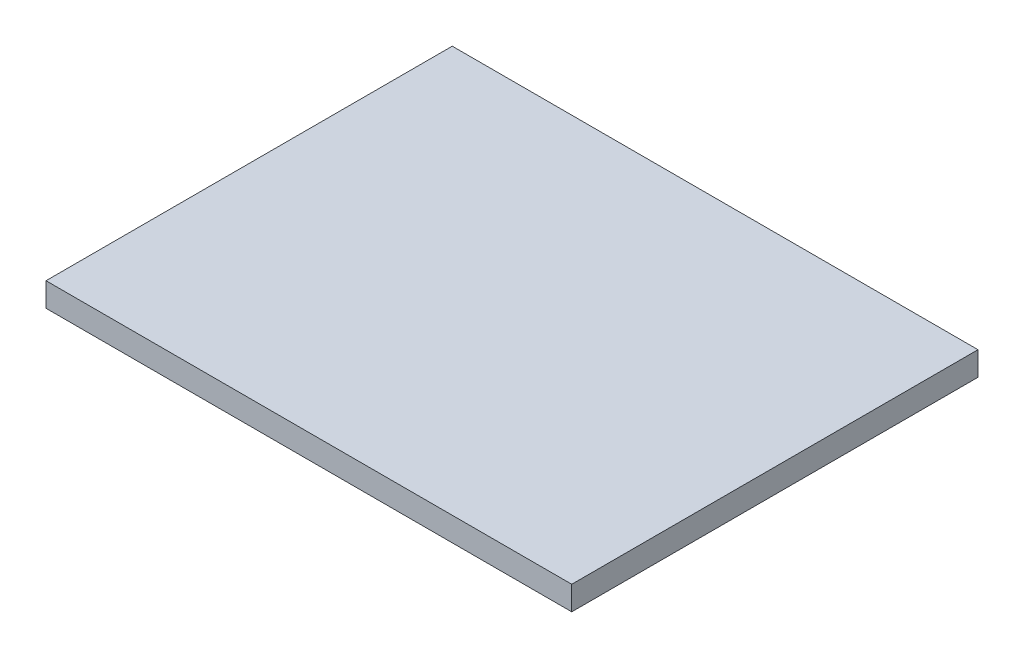
ISO-10303-21;
HEADER;
FILE_DESCRIPTION(('STEP AP214'),'2;1');
FILE_NAME('part.step','',(''),(''),'','','');
FILE_SCHEMA(('AUTOMOTIVE_DESIGN { 1 0 10303 214 1 1 1 1 }'));
ENDSEC;
DATA;
#1=APPLICATION_CONTEXT('core data for automotive mechanical design processes');
#2=APPLICATION_PROTOCOL_DEFINITION('international standard','automotive_design',2000,#1);
#3=PRODUCT_CONTEXT('',#1,'mechanical');
#4=PRODUCT('Part','Part','',(#3));
#5=PRODUCT_RELATED_PRODUCT_CATEGORY('part','',(#4));
#6=PRODUCT_DEFINITION_FORMATION('','',#4);
#7=PRODUCT_DEFINITION_CONTEXT('part definition',#1,'design');
#8=PRODUCT_DEFINITION('design','',#6,#7);
#9=PRODUCT_DEFINITION_SHAPE('','',#8);
#10=(LENGTH_UNIT() NAMED_UNIT(*) SI_UNIT(.MILLI.,.METRE.));
#11=(NAMED_UNIT(*) PLANE_ANGLE_UNIT() SI_UNIT($,.RADIAN.));
#12=(NAMED_UNIT(*) SI_UNIT($,.STERADIAN.) SOLID_ANGLE_UNIT());
#13=UNCERTAINTY_MEASURE_WITH_UNIT(LENGTH_MEASURE(1.E-05),#10,'distance_accuracy_value','');
#14=(GEOMETRIC_REPRESENTATION_CONTEXT(3) GLOBAL_UNCERTAINTY_ASSIGNED_CONTEXT((#13)) GLOBAL_UNIT_ASSIGNED_CONTEXT((#10,
#11,#12)) REPRESENTATION_CONTEXT('',''));
#15=CARTESIAN_POINT('',(0.,0.,0.));
#16=DIRECTION('',(0.,0.,1.));
#17=DIRECTION('',(1.,0.,0.));
#18=AXIS2_PLACEMENT_3D('',#15,#16,#17);
#19=CARTESIAN_POINT('',(22.,2.,17.));
#20=DIRECTION('',(-1.,0.,0.));
#21=DIRECTION('',(0.,0.,1.));
#22=AXIS2_PLACEMENT_3D('',#19,#20,#21);
#23=PLANE('',#22);
#24=DIRECTION('',(0.,0.,-1.));
#25=VECTOR('',#24,1.);
#26=CARTESIAN_POINT('',(22.,0.,17.));
#27=LINE('',#26,#25);
#28=CARTESIAN_POINT('',(22.,0.,17.));
#29=VERTEX_POINT('',#28);
#30=CARTESIAN_POINT('',(22.,0.,-17.));
#31=VERTEX_POINT('',#30);
#32=EDGE_CURVE('E98',#29,#31,#27,.T.);
#33=ORIENTED_EDGE('',*,*,#32,.T.);
#34=DIRECTION('',(0.,-1.,0.));
#35=VECTOR('',#34,1.);
#36=CARTESIAN_POINT('',(22.,2.,-17.));
#37=LINE('',#36,#35);
#38=CARTESIAN_POINT('',(22.,2.,-17.));
#39=VERTEX_POINT('',#38);
#40=EDGE_CURVE('E11',#39,#31,#37,.T.);
#41=ORIENTED_EDGE('',*,*,#40,.F.);
#42=DIRECTION('',(0.,0.,-1.));
#43=VECTOR('',#42,1.);
#44=CARTESIAN_POINT('',(22.,2.,17.));
#45=LINE('',#44,#43);
#46=CARTESIAN_POINT('',(22.,2.,17.));
#47=VERTEX_POINT('',#46);
#48=EDGE_CURVE('E86',#47,#39,#45,.T.);
#49=ORIENTED_EDGE('',*,*,#48,.F.);
#50=DIRECTION('',(0.,-1.,0.));
#51=VECTOR('',#50,1.);
#52=CARTESIAN_POINT('',(22.,2.,17.));
#53=LINE('',#52,#51);
#54=EDGE_CURVE('E94',#47,#29,#53,.T.);
#55=ORIENTED_EDGE('',*,*,#54,.T.);
#56=EDGE_LOOP('',(#33,#41,#49,#55));
#57=FACE_BOUND('',#56,.T.);
#58=ADVANCED_FACE('F35',(#57),#23,.F.);
#59=CARTESIAN_POINT('',(-22.,2.,-17.));
#60=DIRECTION('',(0.,0.,1.));
#61=DIRECTION('',(1.,0.,0.));
#62=AXIS2_PLACEMENT_3D('',#59,#60,#61);
#63=PLANE('',#62);
#64=DIRECTION('',(-1.,0.,0.));
#65=VECTOR('',#64,1.);
#66=CARTESIAN_POINT('',(-22.,0.,-17.));
#67=LINE('',#66,#65);
#68=CARTESIAN_POINT('',(-22.,0.,-17.));
#69=VERTEX_POINT('',#68);
#70=EDGE_CURVE('E90',#31,#69,#67,.T.);
#71=ORIENTED_EDGE('',*,*,#70,.T.);
#72=DIRECTION('',(0.,-1.,0.));
#73=VECTOR('',#72,1.);
#74=CARTESIAN_POINT('',(-22.,2.,-17.));
#75=LINE('',#74,#73);
#76=CARTESIAN_POINT('',(-22.,2.,-17.));
#77=VERTEX_POINT('',#76);
#78=EDGE_CURVE('E43',#77,#69,#75,.T.);
#79=ORIENTED_EDGE('',*,*,#78,.F.);
#80=DIRECTION('',(-1.,0.,0.));
#81=VECTOR('',#80,1.);
#82=CARTESIAN_POINT('',(-22.,2.,-17.));
#83=LINE('',#82,#81);
#84=EDGE_CURVE('E81',#39,#77,#83,.T.);
#85=ORIENTED_EDGE('',*,*,#84,.F.);
#86=ORIENTED_EDGE('',*,*,#40,.T.);
#87=EDGE_LOOP('',(#71,#79,#85,#86));
#88=FACE_BOUND('',#87,.T.);
#89=ADVANCED_FACE('F89',(#88),#63,.F.);
#90=CARTESIAN_POINT('',(-22.,2.,17.));
#91=DIRECTION('',(1.,0.,0.));
#92=DIRECTION('',(0.,0.,-1.));
#93=AXIS2_PLACEMENT_3D('',#90,#91,#92);
#94=PLANE('',#93);
#95=DIRECTION('',(0.,0.,1.));
#96=VECTOR('',#95,1.);
#97=CARTESIAN_POINT('',(-22.,0.,17.));
#98=LINE('',#97,#96);
#99=CARTESIAN_POINT('',(-22.,0.,17.));
#100=VERTEX_POINT('',#99);
#101=EDGE_CURVE('E68',#69,#100,#98,.T.);
#102=ORIENTED_EDGE('',*,*,#101,.T.);
#103=DIRECTION('',(0.,-1.,0.));
#104=VECTOR('',#103,1.);
#105=CARTESIAN_POINT('',(-22.,2.,17.));
#106=LINE('',#105,#104);
#107=CARTESIAN_POINT('',(-22.,2.,17.));
#108=VERTEX_POINT('',#107);
#109=EDGE_CURVE('E91',#108,#100,#106,.T.);
#110=ORIENTED_EDGE('',*,*,#109,.F.);
#111=DIRECTION('',(0.,0.,1.));
#112=VECTOR('',#111,1.);
#113=CARTESIAN_POINT('',(-22.,2.,17.));
#114=LINE('',#113,#112);
#115=EDGE_CURVE('E84',#77,#108,#114,.T.);
#116=ORIENTED_EDGE('',*,*,#115,.F.);
#117=ORIENTED_EDGE('',*,*,#78,.T.);
#118=EDGE_LOOP('',(#102,#110,#116,#117));
#119=FACE_BOUND('',#118,.T.);
#120=ADVANCED_FACE('F92',(#119),#94,.F.);
#121=CARTESIAN_POINT('',(-22.,2.,17.));
#122=DIRECTION('',(0.,0.,-1.));
#123=DIRECTION('',(-1.,0.,0.));
#124=AXIS2_PLACEMENT_3D('',#121,#122,#123);
#125=PLANE('',#124);
#126=DIRECTION('',(1.,0.,0.));
#127=VECTOR('',#126,1.);
#128=CARTESIAN_POINT('',(-22.,0.,17.));
#129=LINE('',#128,#127);
#130=EDGE_CURVE('E74',#100,#29,#129,.T.);
#131=ORIENTED_EDGE('',*,*,#130,.T.);
#132=ORIENTED_EDGE('',*,*,#54,.F.);
#133=DIRECTION('',(1.,0.,0.));
#134=VECTOR('',#133,1.);
#135=CARTESIAN_POINT('',(-22.,2.,17.));
#136=LINE('',#135,#134);
#137=EDGE_CURVE('E51',#108,#47,#136,.T.);
#138=ORIENTED_EDGE('',*,*,#137,.F.);
#139=ORIENTED_EDGE('',*,*,#109,.T.);
#140=EDGE_LOOP('',(#131,#132,#138,#139));
#141=FACE_BOUND('',#140,.T.);
#142=ADVANCED_FACE('F105',(#141),#125,.F.);
#143=CARTESIAN_POINT('',(0.,2.,0.));
#144=DIRECTION('',(0.,-1.,0.));
#145=DIRECTION('',(0.,0.,-1.));
#146=AXIS2_PLACEMENT_3D('',#143,#144,#145);
#147=PLANE('',#146);
#148=ORIENTED_EDGE('',*,*,#48,.T.);
#149=ORIENTED_EDGE('',*,*,#84,.T.);
#150=ORIENTED_EDGE('',*,*,#115,.T.);
#151=ORIENTED_EDGE('',*,*,#137,.T.);
#152=EDGE_LOOP('',(#148,#149,#150,#151));
#153=FACE_BOUND('',#152,.T.);
#154=ADVANCED_FACE('F82',(#153),#147,.F.);
#155=CARTESIAN_POINT('',(0.,0.,0.));
#156=DIRECTION('',(0.,-1.,0.));
#157=DIRECTION('',(0.,0.,-1.));
#158=AXIS2_PLACEMENT_3D('',#155,#156,#157);
#159=PLANE('',#158);
#160=ORIENTED_EDGE('',*,*,#32,.F.);
#161=ORIENTED_EDGE('',*,*,#130,.F.);
#162=ORIENTED_EDGE('',*,*,#101,.F.);
#163=ORIENTED_EDGE('',*,*,#70,.F.);
#164=EDGE_LOOP('',(#160,#161,#162,#163));
#165=FACE_BOUND('',#164,.T.);
#166=ADVANCED_FACE('F108',(#165),#159,.T.);
#167=CLOSED_SHELL('',(#58,#89,#120,#142,#154,#166));
#168=MANIFOLD_SOLID_BREP('B2',#167);
#169=ADVANCED_BREP_SHAPE_REPRESENTATION('',(#18,#168),#14);
#170=SHAPE_DEFINITION_REPRESENTATION(#9,#169);
ENDSEC;
END-ISO-10303-21;
